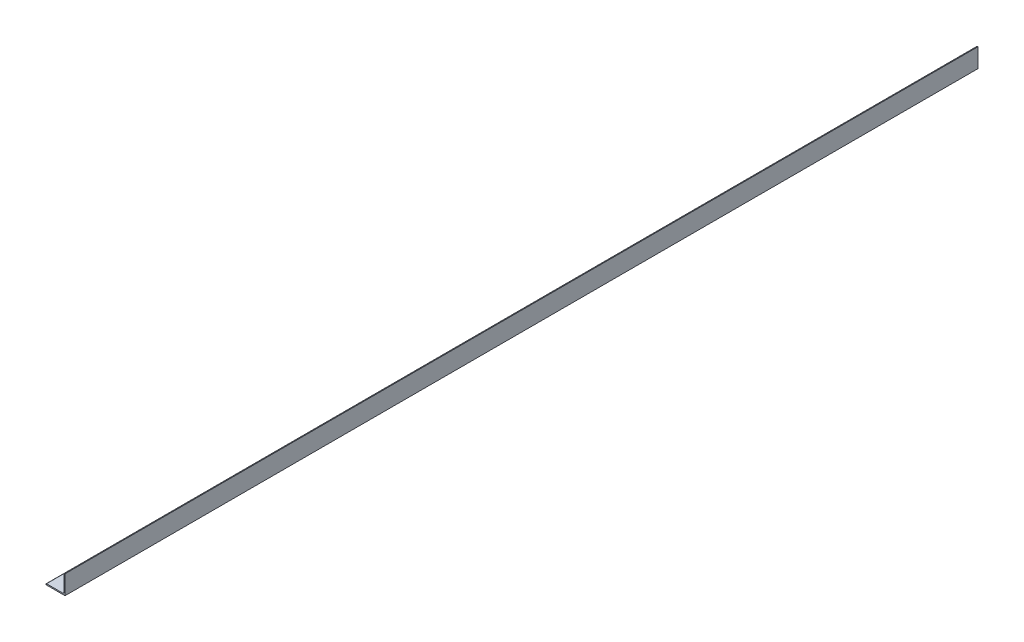
ISO-10303-21;
HEADER;
FILE_DESCRIPTION(('STEP AP214'),'2;1');
FILE_NAME('part.step','',(''),(''),'','','');
FILE_SCHEMA(('AUTOMOTIVE_DESIGN { 1 0 10303 214 1 1 1 1 }'));
ENDSEC;
DATA;
#1=APPLICATION_CONTEXT('core data for automotive mechanical design processes');
#2=APPLICATION_PROTOCOL_DEFINITION('international standard','automotive_design',2000,#1);
#3=PRODUCT_CONTEXT('',#1,'mechanical');
#4=PRODUCT('Part','Part','',(#3));
#5=PRODUCT_RELATED_PRODUCT_CATEGORY('part','',(#4));
#6=PRODUCT_DEFINITION_FORMATION('','',#4);
#7=PRODUCT_DEFINITION_CONTEXT('part definition',#1,'design');
#8=PRODUCT_DEFINITION('design','',#6,#7);
#9=PRODUCT_DEFINITION_SHAPE('','',#8);
#10=(LENGTH_UNIT() NAMED_UNIT(*) SI_UNIT(.MILLI.,.METRE.));
#11=(NAMED_UNIT(*) PLANE_ANGLE_UNIT() SI_UNIT($,.RADIAN.));
#12=(NAMED_UNIT(*) SI_UNIT($,.STERADIAN.) SOLID_ANGLE_UNIT());
#13=UNCERTAINTY_MEASURE_WITH_UNIT(LENGTH_MEASURE(1.E-05),#10,'distance_accuracy_value','');
#14=(GEOMETRIC_REPRESENTATION_CONTEXT(3) GLOBAL_UNCERTAINTY_ASSIGNED_CONTEXT((#13)) GLOBAL_UNIT_ASSIGNED_CONTEXT((#10,
#11,#12)) REPRESENTATION_CONTEXT('',''));
#15=CARTESIAN_POINT('',(0.,0.,0.));
#16=DIRECTION('',(0.,0.,1.));
#17=DIRECTION('',(1.,0.,0.));
#18=AXIS2_PLACEMENT_3D('',#15,#16,#17);
#19=CARTESIAN_POINT('',(-12.7,-11.90625,609.6));
#20=DIRECTION('',(1.,0.,0.));
#21=DIRECTION('',(0.,0.,-1.));
#22=AXIS2_PLACEMENT_3D('',#19,#20,#21);
#23=PLANE('',#22);
#24=DIRECTION('',(0.,-1.,0.));
#25=VECTOR('',#24,1.);
#26=CARTESIAN_POINT('',(-12.7,-11.90625,-609.6));
#27=LINE('',#26,#25);
#28=CARTESIAN_POINT('',(-12.7,-11.90625,-609.6));
#29=VERTEX_POINT('',#28);
#30=CARTESIAN_POINT('',(-12.7,-12.7,-609.6));
#31=VERTEX_POINT('',#30);
#32=EDGE_CURVE('E136',#29,#31,#27,.T.);
#33=ORIENTED_EDGE('',*,*,#32,.T.);
#34=DIRECTION('',(0.,0.,-1.));
#35=VECTOR('',#34,1.);
#36=CARTESIAN_POINT('',(-12.7,-12.7,609.6));
#37=LINE('',#36,#35);
#38=CARTESIAN_POINT('',(-12.7,-12.7,609.6));
#39=VERTEX_POINT('',#38);
#40=EDGE_CURVE('E11',#39,#31,#37,.T.);
#41=ORIENTED_EDGE('',*,*,#40,.F.);
#42=DIRECTION('',(0.,-1.,0.));
#43=VECTOR('',#42,1.);
#44=CARTESIAN_POINT('',(-12.7,-11.90625,609.6));
#45=LINE('',#44,#43);
#46=CARTESIAN_POINT('',(-12.7,-11.90625,609.6));
#47=VERTEX_POINT('',#46);
#48=EDGE_CURVE('E152',#47,#39,#45,.T.);
#49=ORIENTED_EDGE('',*,*,#48,.F.);
#50=DIRECTION('',(0.,0.,-1.));
#51=VECTOR('',#50,1.);
#52=CARTESIAN_POINT('',(-12.7,-11.90625,609.6));
#53=LINE('',#52,#51);
#54=EDGE_CURVE('E132',#47,#29,#53,.T.);
#55=ORIENTED_EDGE('',*,*,#54,.T.);
#56=EDGE_LOOP('',(#33,#41,#49,#55));
#57=FACE_BOUND('',#56,.T.);
#58=ADVANCED_FACE('F34',(#57),#23,.F.);
#59=CARTESIAN_POINT('',(-12.7,-12.7,609.6));
#60=DIRECTION('',(0.,1.,0.));
#61=DIRECTION('',(-1.,0.,0.));
#62=AXIS2_PLACEMENT_3D('',#59,#60,#61);
#63=PLANE('',#62);
#64=DIRECTION('',(1.,0.,0.));
#65=VECTOR('',#64,1.);
#66=CARTESIAN_POINT('',(-12.7,-12.7,-609.6));
#67=LINE('',#66,#65);
#68=CARTESIAN_POINT('',(12.7,-12.7,-609.6));
#69=VERTEX_POINT('',#68);
#70=EDGE_CURVE('E139',#31,#69,#67,.T.);
#71=ORIENTED_EDGE('',*,*,#70,.T.);
#72=DIRECTION('',(0.,0.,-1.));
#73=VECTOR('',#72,1.);
#74=CARTESIAN_POINT('',(12.7,-12.7,609.6));
#75=LINE('',#74,#73);
#76=CARTESIAN_POINT('',(12.7,-12.7,609.6));
#77=VERTEX_POINT('',#76);
#78=EDGE_CURVE('E42',#77,#69,#75,.T.);
#79=ORIENTED_EDGE('',*,*,#78,.F.);
#80=DIRECTION('',(1.,0.,0.));
#81=VECTOR('',#80,1.);
#82=CARTESIAN_POINT('',(-12.7,-12.7,609.6));
#83=LINE('',#82,#81);
#84=EDGE_CURVE('E96',#39,#77,#83,.T.);
#85=ORIENTED_EDGE('',*,*,#84,.F.);
#86=ORIENTED_EDGE('',*,*,#40,.T.);
#87=EDGE_LOOP('',(#71,#79,#85,#86));
#88=FACE_BOUND('',#87,.T.);
#89=ADVANCED_FACE('F195',(#88),#63,.F.);
#90=CARTESIAN_POINT('',(12.7,-12.7,609.6));
#91=DIRECTION('',(-1.,0.,0.));
#92=DIRECTION('',(0.,-1.,0.));
#93=AXIS2_PLACEMENT_3D('',#90,#91,#92);
#94=PLANE('',#93);
#95=DIRECTION('',(0.,1.,0.));
#96=VECTOR('',#95,1.);
#97=CARTESIAN_POINT('',(12.7,-12.7,-609.6));
#98=LINE('',#97,#96);
#99=CARTESIAN_POINT('',(12.7,12.7,-609.6));
#100=VERTEX_POINT('',#99);
#101=EDGE_CURVE('E141',#69,#100,#98,.T.);
#102=ORIENTED_EDGE('',*,*,#101,.T.);
#103=DIRECTION('',(0.,0.,-1.));
#104=VECTOR('',#103,1.);
#105=CARTESIAN_POINT('',(12.7,12.7,609.6));
#106=LINE('',#105,#104);
#107=CARTESIAN_POINT('',(12.7,12.7,609.6));
#108=VERTEX_POINT('',#107);
#109=EDGE_CURVE('E162',#108,#100,#106,.T.);
#110=ORIENTED_EDGE('',*,*,#109,.F.);
#111=DIRECTION('',(0.,1.,0.));
#112=VECTOR('',#111,1.);
#113=CARTESIAN_POINT('',(12.7,-12.7,609.6));
#114=LINE('',#113,#112);
#115=EDGE_CURVE('E170',#77,#108,#114,.T.);
#116=ORIENTED_EDGE('',*,*,#115,.F.);
#117=ORIENTED_EDGE('',*,*,#78,.T.);
#118=EDGE_LOOP('',(#102,#110,#116,#117));
#119=FACE_BOUND('',#118,.T.);
#120=ADVANCED_FACE('F168',(#119),#94,.F.);
#121=CARTESIAN_POINT('',(11.90625,12.7,609.6));
#122=DIRECTION('',(0.,-1.,0.));
#123=DIRECTION('',(0.,0.,-1.));
#124=AXIS2_PLACEMENT_3D('',#121,#122,#123);
#125=PLANE('',#124);
#126=DIRECTION('',(-1.,0.,0.));
#127=VECTOR('',#126,1.);
#128=CARTESIAN_POINT('',(11.90625,12.7,-609.6));
#129=LINE('',#128,#127);
#130=CARTESIAN_POINT('',(11.90625,12.7,-609.6));
#131=VERTEX_POINT('',#130);
#132=EDGE_CURVE('E143',#100,#131,#129,.T.);
#133=ORIENTED_EDGE('',*,*,#132,.T.);
#134=DIRECTION('',(0.,0.,-1.));
#135=VECTOR('',#134,1.);
#136=CARTESIAN_POINT('',(11.90625,12.7,609.6));
#137=LINE('',#136,#135);
#138=CARTESIAN_POINT('',(11.90625,12.7,609.6));
#139=VERTEX_POINT('',#138);
#140=EDGE_CURVE('E159',#139,#131,#137,.T.);
#141=ORIENTED_EDGE('',*,*,#140,.F.);
#142=DIRECTION('',(-1.,0.,0.));
#143=VECTOR('',#142,1.);
#144=CARTESIAN_POINT('',(11.90625,12.7,609.6));
#145=LINE('',#144,#143);
#146=EDGE_CURVE('E186',#108,#139,#145,.T.);
#147=ORIENTED_EDGE('',*,*,#146,.F.);
#148=ORIENTED_EDGE('',*,*,#109,.T.);
#149=EDGE_LOOP('',(#133,#141,#147,#148));
#150=FACE_BOUND('',#149,.T.);
#151=ADVANCED_FACE('F179',(#150),#125,.F.);
#152=CARTESIAN_POINT('',(11.90625,11.90625,609.6));
#153=DIRECTION('',(0.,0.,-1.));
#154=DIRECTION('',(-1.,0.,0.));
#155=AXIS2_PLACEMENT_3D('',#152,#153,#154);
#156=CYLINDRICAL_SURFACE('',#155,0.793749999999998);
#157=CARTESIAN_POINT('',(11.90625,11.90625,-609.6));
#158=DIRECTION('',(0.,0.,1.));
#159=DIRECTION('',(-1.,0.,0.));
#160=AXIS2_PLACEMENT_3D('',#157,#158,#159);
#161=CIRCLE('',#160,0.793749999999998);
#162=CARTESIAN_POINT('',(11.1125,11.90625,-609.6));
#163=VERTEX_POINT('',#162);
#164=EDGE_CURVE('E145',#131,#163,#161,.T.);
#165=ORIENTED_EDGE('',*,*,#164,.T.);
#166=DIRECTION('',(0.,0.,-1.));
#167=VECTOR('',#166,1.);
#168=CARTESIAN_POINT('',(11.1125,11.90625,609.6));
#169=LINE('',#168,#167);
#170=CARTESIAN_POINT('',(11.1125,11.90625,609.6));
#171=VERTEX_POINT('',#170);
#172=EDGE_CURVE('E156',#171,#163,#169,.T.);
#173=ORIENTED_EDGE('',*,*,#172,.F.);
#174=CARTESIAN_POINT('',(11.90625,11.90625,609.6));
#175=DIRECTION('',(0.,0.,1.));
#176=DIRECTION('',(-1.,0.,0.));
#177=AXIS2_PLACEMENT_3D('',#174,#175,#176);
#178=CIRCLE('',#177,0.793749999999998);
#179=EDGE_CURVE('E185',#139,#171,#178,.T.);
#180=ORIENTED_EDGE('',*,*,#179,.F.);
#181=ORIENTED_EDGE('',*,*,#140,.T.);
#182=EDGE_LOOP('',(#165,#173,#180,#181));
#183=FACE_BOUND('',#182,.T.);
#184=ADVANCED_FACE('F183',(#183),#156,.T.);
#185=CARTESIAN_POINT('',(11.1125,11.90625,609.6));
#186=DIRECTION('',(1.,0.,0.));
#187=DIRECTION('',(0.,1.,0.));
#188=AXIS2_PLACEMENT_3D('',#185,#186,#187);
#189=PLANE('',#188);
#190=DIRECTION('',(0.,-1.,0.));
#191=VECTOR('',#190,1.);
#192=CARTESIAN_POINT('',(11.1125,11.90625,-609.6));
#193=LINE('',#192,#191);
#194=CARTESIAN_POINT('',(11.1125,-9.5377,-609.6));
#195=VERTEX_POINT('',#194);
#196=EDGE_CURVE('E147',#163,#195,#193,.T.);
#197=ORIENTED_EDGE('',*,*,#196,.T.);
#198=DIRECTION('',(0.,0.,-1.));
#199=VECTOR('',#198,1.);
#200=CARTESIAN_POINT('',(11.1125,-9.5377,609.6));
#201=LINE('',#200,#199);
#202=CARTESIAN_POINT('',(11.1125,-9.5377,609.6));
#203=VERTEX_POINT('',#202);
#204=EDGE_CURVE('E127',#203,#195,#201,.T.);
#205=ORIENTED_EDGE('',*,*,#204,.F.);
#206=DIRECTION('',(0.,-1.,0.));
#207=VECTOR('',#206,1.);
#208=CARTESIAN_POINT('',(11.1125,11.90625,609.6));
#209=LINE('',#208,#207);
#210=EDGE_CURVE('E118',#171,#203,#209,.T.);
#211=ORIENTED_EDGE('',*,*,#210,.F.);
#212=ORIENTED_EDGE('',*,*,#172,.T.);
#213=EDGE_LOOP('',(#197,#205,#211,#212));
#214=FACE_BOUND('',#213,.T.);
#215=ADVANCED_FACE('F207',(#214),#189,.F.);
#216=CARTESIAN_POINT('',(9.5377,-9.5377,609.6));
#217=DIRECTION('',(0.,0.,-1.));
#218=DIRECTION('',(-1.,0.,0.));
#219=AXIS2_PLACEMENT_3D('',#216,#217,#218);
#220=CYLINDRICAL_SURFACE('',#219,1.5748);
#221=CARTESIAN_POINT('',(9.5377,-9.5377,-609.6));
#222=DIRECTION('',(0.,0.,-1.));
#223=DIRECTION('',(-1.,0.,0.));
#224=AXIS2_PLACEMENT_3D('',#221,#222,#223);
#225=CIRCLE('',#224,1.5748);
#226=CARTESIAN_POINT('',(9.5377,-11.1125,-609.6));
#227=VERTEX_POINT('',#226);
#228=EDGE_CURVE('E126',#195,#227,#225,.T.);
#229=ORIENTED_EDGE('',*,*,#228,.T.);
#230=DIRECTION('',(0.,0.,-1.));
#231=VECTOR('',#230,1.);
#232=CARTESIAN_POINT('',(9.5377,-11.1125,609.6));
#233=LINE('',#232,#231);
#234=CARTESIAN_POINT('',(9.5377,-11.1125,609.6));
#235=VERTEX_POINT('',#234);
#236=EDGE_CURVE('E123',#235,#227,#233,.T.);
#237=ORIENTED_EDGE('',*,*,#236,.F.);
#238=CARTESIAN_POINT('',(9.5377,-9.5377,609.6));
#239=DIRECTION('',(0.,0.,-1.));
#240=DIRECTION('',(-1.,0.,0.));
#241=AXIS2_PLACEMENT_3D('',#238,#239,#240);
#242=CIRCLE('',#241,1.5748);
#243=EDGE_CURVE('E112',#203,#235,#242,.T.);
#244=ORIENTED_EDGE('',*,*,#243,.F.);
#245=ORIENTED_EDGE('',*,*,#204,.T.);
#246=EDGE_LOOP('',(#229,#237,#244,#245));
#247=FACE_BOUND('',#246,.T.);
#248=ADVANCED_FACE('F124',(#247),#220,.F.);
#249=CARTESIAN_POINT('',(9.5377,-11.1125,609.6));
#250=DIRECTION('',(0.,-1.,0.));
#251=DIRECTION('',(0.,0.,-1.));
#252=AXIS2_PLACEMENT_3D('',#249,#250,#251);
#253=PLANE('',#252);
#254=DIRECTION('',(-1.,0.,0.));
#255=VECTOR('',#254,1.);
#256=CARTESIAN_POINT('',(9.5377,-11.1125,-609.6));
#257=LINE('',#256,#255);
#258=CARTESIAN_POINT('',(-11.90625,-11.1125,-609.6));
#259=VERTEX_POINT('',#258);
#260=EDGE_CURVE('E82',#227,#259,#257,.T.);
#261=ORIENTED_EDGE('',*,*,#260,.T.);
#262=DIRECTION('',(0.,0.,-1.));
#263=VECTOR('',#262,1.);
#264=CARTESIAN_POINT('',(-11.90625,-11.1125,609.6));
#265=LINE('',#264,#263);
#266=CARTESIAN_POINT('',(-11.90625,-11.1125,609.6));
#267=VERTEX_POINT('',#266);
#268=EDGE_CURVE('E128',#267,#259,#265,.T.);
#269=ORIENTED_EDGE('',*,*,#268,.F.);
#270=DIRECTION('',(-1.,0.,0.));
#271=VECTOR('',#270,1.);
#272=CARTESIAN_POINT('',(9.5377,-11.1125,609.6));
#273=LINE('',#272,#271);
#274=EDGE_CURVE('E116',#235,#267,#273,.T.);
#275=ORIENTED_EDGE('',*,*,#274,.F.);
#276=ORIENTED_EDGE('',*,*,#236,.T.);
#277=EDGE_LOOP('',(#261,#269,#275,#276));
#278=FACE_BOUND('',#277,.T.);
#279=ADVANCED_FACE('F130',(#278),#253,.F.);
#280=CARTESIAN_POINT('',(-11.90625,-11.90625,609.6));
#281=DIRECTION('',(0.,0.,-1.));
#282=DIRECTION('',(-1.,0.,0.));
#283=AXIS2_PLACEMENT_3D('',#280,#281,#282);
#284=CYLINDRICAL_SURFACE('',#283,0.79375);
#285=CARTESIAN_POINT('',(-11.90625,-11.90625,-609.6));
#286=DIRECTION('',(0.,0.,1.));
#287=DIRECTION('',(-1.,0.,0.));
#288=AXIS2_PLACEMENT_3D('',#285,#286,#287);
#289=CIRCLE('',#288,0.79375);
#290=EDGE_CURVE('E88',#259,#29,#289,.T.);
#291=ORIENTED_EDGE('',*,*,#290,.T.);
#292=ORIENTED_EDGE('',*,*,#54,.F.);
#293=CARTESIAN_POINT('',(-11.90625,-11.90625,609.6));
#294=DIRECTION('',(0.,0.,1.));
#295=DIRECTION('',(-1.,0.,0.));
#296=AXIS2_PLACEMENT_3D('',#293,#294,#295);
#297=CIRCLE('',#296,0.79375);
#298=EDGE_CURVE('E50',#267,#47,#297,.T.);
#299=ORIENTED_EDGE('',*,*,#298,.F.);
#300=ORIENTED_EDGE('',*,*,#268,.T.);
#301=EDGE_LOOP('',(#291,#292,#299,#300));
#302=FACE_BOUND('',#301,.T.);
#303=ADVANCED_FACE('F215',(#302),#284,.T.);
#304=CARTESIAN_POINT('',(11.90625,11.90625,609.6));
#305=DIRECTION('',(0.,0.,-1.));
#306=DIRECTION('',(-1.,0.,0.));
#307=AXIS2_PLACEMENT_3D('',#304,#305,#306);
#308=PLANE('',#307);
#309=ORIENTED_EDGE('',*,*,#48,.T.);
#310=ORIENTED_EDGE('',*,*,#84,.T.);
#311=ORIENTED_EDGE('',*,*,#115,.T.);
#312=ORIENTED_EDGE('',*,*,#146,.T.);
#313=ORIENTED_EDGE('',*,*,#179,.T.);
#314=ORIENTED_EDGE('',*,*,#210,.T.);
#315=ORIENTED_EDGE('',*,*,#243,.T.);
#316=ORIENTED_EDGE('',*,*,#274,.T.);
#317=ORIENTED_EDGE('',*,*,#298,.T.);
#318=EDGE_LOOP('',(#309,#310,#311,#312,#313,#314,#315,#316,#317));
#319=FACE_BOUND('',#318,.T.);
#320=ADVANCED_FACE('F114',(#319),#308,.F.);
#321=CARTESIAN_POINT('',(11.90625,11.90625,-609.6));
#322=DIRECTION('',(0.,0.,-1.));
#323=DIRECTION('',(-1.,0.,0.));
#324=AXIS2_PLACEMENT_3D('',#321,#322,#323);
#325=PLANE('',#324);
#326=ORIENTED_EDGE('',*,*,#32,.F.);
#327=ORIENTED_EDGE('',*,*,#290,.F.);
#328=ORIENTED_EDGE('',*,*,#260,.F.);
#329=ORIENTED_EDGE('',*,*,#228,.F.);
#330=ORIENTED_EDGE('',*,*,#196,.F.);
#331=ORIENTED_EDGE('',*,*,#164,.F.);
#332=ORIENTED_EDGE('',*,*,#132,.F.);
#333=ORIENTED_EDGE('',*,*,#101,.F.);
#334=ORIENTED_EDGE('',*,*,#70,.F.);
#335=EDGE_LOOP('',(#326,#327,#328,#329,#330,#331,#332,#333,#334));
#336=FACE_BOUND('',#335,.T.);
#337=ADVANCED_FACE('F174',(#336),#325,.T.);
#338=CLOSED_SHELL('',(#58,#89,#120,#151,#184,#215,#248,#279,#303,#320,#337));
#339=MANIFOLD_SOLID_BREP('B2',#338);
#340=ADVANCED_BREP_SHAPE_REPRESENTATION('',(#18,#339),#14);
#341=SHAPE_DEFINITION_REPRESENTATION(#9,#340);
ENDSEC;
END-ISO-10303-21;
